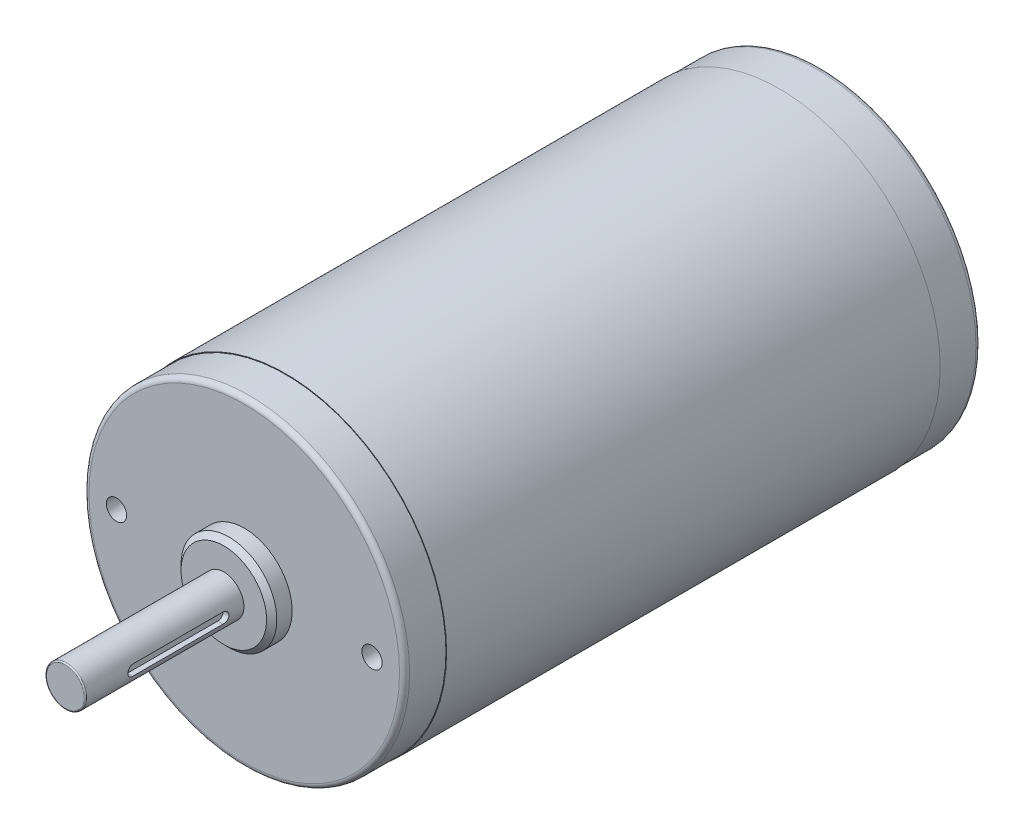
ISO-10303-21;
HEADER;
FILE_DESCRIPTION(('STEP AP214'),'2;1');
FILE_NAME('part.step','',(''),(''),'','','');
FILE_SCHEMA(('AUTOMOTIVE_DESIGN { 1 0 10303 214 1 1 1 1 }'));
ENDSEC;
DATA;
#1=APPLICATION_CONTEXT('core data for automotive mechanical design processes');
#2=APPLICATION_PROTOCOL_DEFINITION('international standard','automotive_design',2000,#1);
#3=PRODUCT_CONTEXT('',#1,'mechanical');
#4=PRODUCT('Part','Part','',(#3));
#5=PRODUCT_RELATED_PRODUCT_CATEGORY('part','',(#4));
#6=PRODUCT_DEFINITION_FORMATION('','',#4);
#7=PRODUCT_DEFINITION_CONTEXT('part definition',#1,'design');
#8=PRODUCT_DEFINITION('design','',#6,#7);
#9=PRODUCT_DEFINITION_SHAPE('','',#8);
#10=(LENGTH_UNIT() NAMED_UNIT(*) SI_UNIT(.MILLI.,.METRE.));
#11=(NAMED_UNIT(*) PLANE_ANGLE_UNIT() SI_UNIT($,.RADIAN.));
#12=(NAMED_UNIT(*) SI_UNIT($,.STERADIAN.) SOLID_ANGLE_UNIT());
#13=UNCERTAINTY_MEASURE_WITH_UNIT(LENGTH_MEASURE(1.E-05),#10,'distance_accuracy_value','');
#14=(GEOMETRIC_REPRESENTATION_CONTEXT(3) GLOBAL_UNCERTAINTY_ASSIGNED_CONTEXT((#13)) GLOBAL_UNIT_ASSIGNED_CONTEXT((#10,
#11,#12)) REPRESENTATION_CONTEXT('',''));
#15=CARTESIAN_POINT('',(0.,0.,0.));
#16=DIRECTION('',(0.,0.,1.));
#17=DIRECTION('',(1.,0.,0.));
#18=AXIS2_PLACEMENT_3D('',#15,#16,#17);
#19=CARTESIAN_POINT('',(35.56,109.2962,54.614));
#20=DIRECTION('',(0.,0.,1.));
#21=DIRECTION('',(1.,0.,0.));
#22=AXIS2_PLACEMENT_3D('',#19,#20,#21);
#23=PLANE('',#22);
#24=CARTESIAN_POINT('',(35.56,109.2962,54.614));
#25=DIRECTION('',(0.,0.,-1.));
#26=DIRECTION('',(-1.,0.,0.));
#27=AXIS2_PLACEMENT_3D('',#24,#25,#26);
#28=CIRCLE('',#27,3.746);
#29=CARTESIAN_POINT('',(31.814,109.2962,54.614));
#30=VERTEX_POINT('',#29);
#31=CARTESIAN_POINT('',(39.306,109.2962,54.614));
#32=VERTEX_POINT('',#31);
#33=EDGE_CURVE('E122',#30,#32,#28,.T.);
#34=ORIENTED_EDGE('',*,*,#33,.F.);
#35=CARTESIAN_POINT('',(39.306,109.2962,54.614));
#36=CARTESIAN_POINT('',(39.3060013001946,109.234906156435,54.614));
#37=CARTESIAN_POINT('',(39.3044956705508,109.173612423503,54.614));
#38=CARTESIAN_POINT('',(39.2984798873383,109.051172560436,54.614));
#39=CARTESIAN_POINT('',(39.2939697337696,108.9900264303,54.614));
#40=CARTESIAN_POINT('',(39.2819542384585,108.868029154351,54.614));
#41=CARTESIAN_POINT('',(39.2744488967163,108.807178008539,54.614));
#42=CARTESIAN_POINT('',(39.2564615159399,108.685917276842,54.614));
#43=CARTESIAN_POINT('',(39.2459794769058,108.625507690958,54.614));
#44=CARTESIAN_POINT('',(39.2220638438752,108.505275616497,54.614));
#45=CARTESIAN_POINT('',(39.2086302498789,108.445453127921,54.614));
#46=CARTESIAN_POINT('',(39.1788438990547,108.326539364244,54.614));
#47=CARTESIAN_POINT('',(39.1624911422269,108.267448089144,54.614));
#48=CARTESIAN_POINT('',(39.1269058530788,108.150139108865,54.614));
#49=CARTESIAN_POINT('',(39.1076733207584,108.091921403687,54.614));
#50=CARTESIAN_POINT('',(39.0663748155928,107.976499814699,54.614));
#51=CARTESIAN_POINT('',(39.0443088427474,107.919295930889,54.614));
#52=CARTESIAN_POINT('',(38.9973966148271,107.806039793832,54.614));
#53=CARTESIAN_POINT('',(38.9725503597521,107.749987540585,54.614));
#54=CARTESIAN_POINT('',(38.9201374243288,107.639169699435,54.614));
#55=CARTESIAN_POINT('',(38.8925707439804,107.584404111532,54.614));
#56=CARTESIAN_POINT('',(38.8347833685174,107.476291536168,54.614));
#57=CARTESIAN_POINT('',(38.8045626734027,107.422944548708,54.614));
#58=CARTESIAN_POINT('',(38.7415400727193,107.317797691796,54.614));
#59=CARTESIAN_POINT('',(38.7087381671506,107.265997822345,54.614));
#60=CARTESIAN_POINT('',(38.64063216822,107.164069991872,54.614));
#61=CARTESIAN_POINT('',(38.6053280748581,107.113942030852,54.614));
#62=CARTESIAN_POINT('',(38.5323027509949,107.015478779891,54.614));
#63=CARTESIAN_POINT('',(38.4945815204937,106.96714348995,54.614));
#64=CARTESIAN_POINT('',(38.4168127961,106.872382025096,54.614));
#65=CARTESIAN_POINT('',(38.3767653022075,106.825955850182,54.614));
#66=CARTESIAN_POINT('',(38.2944405289519,106.735124460104,54.614));
#67=CARTESIAN_POINT('',(38.2521632495887,106.690719244939,54.614));
#68=CARTESIAN_POINT('',(38.1654807550609,106.604036750411,54.614));
#69=CARTESIAN_POINT('',(38.1210755398961,106.561759471048,54.614));
#70=CARTESIAN_POINT('',(38.0302441498177,106.479434697793,54.614));
#71=CARTESIAN_POINT('',(37.9838179749041,106.4393872039,54.614));
#72=CARTESIAN_POINT('',(37.8890565100499,106.361618479506,54.614));
#73=CARTESIAN_POINT('',(37.8407212201092,106.323897249005,54.614));
#74=CARTESIAN_POINT('',(37.7422579691481,106.250871925142,54.614));
#75=CARTESIAN_POINT('',(37.6921300081275,106.21556783178,54.614));
#76=CARTESIAN_POINT('',(37.5902021776553,106.147461832849,54.614));
#77=CARTESIAN_POINT('',(37.5384023082037,106.11465992728,54.614));
#78=CARTESIAN_POINT('',(37.4332554512919,106.051637326598,54.614));
#79=CARTESIAN_POINT('',(37.3799084638318,106.021416631485,54.614));
#80=CARTESIAN_POINT('',(37.2717958884686,105.963629256017,54.614));
#81=CARTESIAN_POINT('',(37.2170303005654,105.936062575662,54.614));
#82=CARTESIAN_POINT('',(37.1062124594143,105.883649640257,54.614));
#83=CARTESIAN_POINT('',(37.0501602061662,105.858803385207,54.614));
#84=CARTESIAN_POINT('',(36.936904069113,105.811891157218,54.614));
#85=CARTESIAN_POINT('',(36.8797001853078,105.789825184278,54.614));
#86=CARTESIAN_POINT('',(36.7642785963067,105.74852667937,54.614));
#87=CARTESIAN_POINT('',(36.7060608911109,105.729294147402,54.614));
#88=CARTESIAN_POINT('',(36.5887519108796,105.693708857292,54.614));
#89=CARTESIAN_POINT('',(36.5296606358442,105.677356099149,54.614));
#90=CARTESIAN_POINT('',(36.4107468719911,105.647569751917,54.614));
#91=CARTESIAN_POINT('',(36.3509243831735,105.634136162827,54.614));
#92=CARTESIAN_POINT('',(36.2306923093714,105.610220516392,54.614));
#93=CARTESIAN_POINT('',(36.1702827243869,105.599738459047,54.614));
#94=CARTESIAN_POINT('',(36.0490219902327,105.581751128297,54.614));
#95=CARTESIAN_POINT('',(35.9881708410629,105.574245854891,54.614));
#96=CARTESIAN_POINT('',(35.8661735742862,105.562230172881,54.614));
#97=CARTESIAN_POINT('',(35.8050274566793,105.557719764276,54.614));
#98=CARTESIAN_POINT('',(35.6825875593817,105.551704677835,54.614));
#99=CARTESIAN_POINT('',(35.6212937796908,105.5502,54.614));
#100=CARTESIAN_POINT('',(35.4987062203092,105.5502,54.614));
#101=CARTESIAN_POINT('',(35.4374124406183,105.551704677835,54.614));
#102=CARTESIAN_POINT('',(35.3149725433206,105.557719764276,54.614));
#103=CARTESIAN_POINT('',(35.2538264257138,105.562230172881,54.614));
#104=CARTESIAN_POINT('',(35.1318291589371,105.574245854891,54.614));
#105=CARTESIAN_POINT('',(35.0709780097673,105.581751128297,54.614));
#106=CARTESIAN_POINT('',(34.9497172756131,105.599738459047,54.614));
#107=CARTESIAN_POINT('',(34.8893076906286,105.610220516392,54.614));
#108=CARTESIAN_POINT('',(34.7690756168265,105.634136162827,54.614));
#109=CARTESIAN_POINT('',(34.7092531280089,105.647569751917,54.614));
#110=CARTESIAN_POINT('',(34.5903393641559,105.677356099149,54.614));
#111=CARTESIAN_POINT('',(34.5312480891204,105.693708857292,54.614));
#112=CARTESIAN_POINT('',(34.4139391088891,105.729294147402,54.614));
#113=CARTESIAN_POINT('',(34.3557214036933,105.748526679371,54.614));
#114=CARTESIAN_POINT('',(34.2402998146922,105.789825184278,54.614));
#115=CARTESIAN_POINT('',(34.183095930887,105.811891157218,54.614));
#116=CARTESIAN_POINT('',(34.0698397938338,105.858803385207,54.614));
#117=CARTESIAN_POINT('',(34.0137875405857,105.883649640257,54.614));
#118=CARTESIAN_POINT('',(33.9029696994346,105.936062575662,54.614));
#119=CARTESIAN_POINT('',(33.8482041115315,105.963629256017,54.614));
#120=CARTESIAN_POINT('',(33.7400915361682,106.021416631485,54.614));
#121=CARTESIAN_POINT('',(33.6867445487081,106.051637326598,54.614));
#122=CARTESIAN_POINT('',(33.5815976917963,106.11465992728,54.614));
#123=CARTESIAN_POINT('',(33.5297978223447,106.147461832849,54.614));
#124=CARTESIAN_POINT('',(33.4278699918725,106.21556783178,54.614));
#125=CARTESIAN_POINT('',(33.3777420308519,106.250871925142,54.614));
#126=CARTESIAN_POINT('',(33.2792787798908,106.323897249005,54.614));
#127=CARTESIAN_POINT('',(33.2309434899501,106.361618479506,54.614));
#128=CARTESIAN_POINT('',(33.1361820250959,106.4393872039,54.614));
#129=CARTESIAN_POINT('',(33.0897558501823,106.479434697793,54.614));
#130=CARTESIAN_POINT('',(32.9989244601039,106.561759471048,54.614));
#131=CARTESIAN_POINT('',(32.9545192449391,106.604036750411,54.614));
#132=CARTESIAN_POINT('',(32.8678367504113,106.690719244939,54.614));
#133=CARTESIAN_POINT('',(32.8255594710481,106.735124460104,54.614));
#134=CARTESIAN_POINT('',(32.7432346977925,106.825955850182,54.614));
#135=CARTESIAN_POINT('',(32.7031872039001,106.872382025096,54.614));
#136=CARTESIAN_POINT('',(32.6254184795063,106.96714348995,54.614));
#137=CARTESIAN_POINT('',(32.5876972490051,107.015478779891,54.614));
#138=CARTESIAN_POINT('',(32.5146719251419,107.113942030852,54.614));
#139=CARTESIAN_POINT('',(32.47936783178,107.164069991872,54.614));
#140=CARTESIAN_POINT('',(32.4112618328494,107.265997822345,54.614));
#141=CARTESIAN_POINT('',(32.3784599272807,107.317797691796,54.614));
#142=CARTESIAN_POINT('',(32.3154373265973,107.422944548708,54.614));
#143=CARTESIAN_POINT('',(32.2852166314826,107.476291536168,54.614));
#144=CARTESIAN_POINT('',(32.2274292560196,107.584404111532,54.614));
#145=CARTESIAN_POINT('',(32.1998625756713,107.639169699435,54.614));
#146=CARTESIAN_POINT('',(32.1474496402479,107.749987540585,54.614));
#147=CARTESIAN_POINT('',(32.1226033851729,107.806039793832,54.614));
#148=CARTESIAN_POINT('',(32.0756911572526,107.919295930889,54.614));
#149=CARTESIAN_POINT('',(32.0536251844072,107.976499814699,54.614));
#150=CARTESIAN_POINT('',(32.0123266792416,108.091921403687,54.614));
#151=CARTESIAN_POINT('',(31.9930941469212,108.150139108866,54.614));
#152=CARTESIAN_POINT('',(31.9575088577731,108.267448089144,54.614));
#153=CARTESIAN_POINT('',(31.9411561009453,108.326539364244,54.614));
#154=CARTESIAN_POINT('',(31.9113697501212,108.445453127921,54.614));
#155=CARTESIAN_POINT('',(31.8979361561248,108.505275616497,54.614));
#156=CARTESIAN_POINT('',(31.8740205230943,108.625507690958,54.614));
#157=CARTESIAN_POINT('',(31.8635384840601,108.685917276842,54.614));
#158=CARTESIAN_POINT('',(31.8455511032837,108.807178008539,54.614));
#159=CARTESIAN_POINT('',(31.8380457615415,108.868029154351,54.614));
#160=CARTESIAN_POINT('',(31.8260302662304,108.9900264303,54.614));
#161=CARTESIAN_POINT('',(31.8215201126617,109.051172560436,54.614));
#162=CARTESIAN_POINT('',(31.8155043294492,109.173612423503,54.614));
#163=CARTESIAN_POINT('',(31.8139986998054,109.234906156435,54.614));
#164=CARTESIAN_POINT('',(31.814,109.2962,54.614));
#165=B_SPLINE_CURVE_WITH_KNOTS('',3,(#35,#36,#37,#38,#39,#40,#41,#42,#43,#44,#45,#46,#47,#48,
#49,#50,#51,#52,#53,#54,#55,#56,#57,#58,#59,#60,#61,#62,#63,#64,#65,#66,#67,#68,#69,#70,#71,#72,
#73,#74,#75,#76,#77,#78,#79,#80,#81,#82,#83,#84,#85,#86,#87,#88,#89,#90,#91,#92,#93,#94,#95,#96,
#97,#98,#99,#100,#101,#102,#103,#104,#105,#106,#107,#108,#109,#110,#111,#112,#113,#114,#115,
#116,#117,#118,#119,#120,#121,#122,#123,#124,#125,#126,#127,#128,#129,#130,#131,#132,#133,#134,
#135,#136,#137,#138,#139,#140,#141,#142,#143,#144,#145,#146,#147,#148,#149,#150,#151,#152,#153,
#154,#155,#156,#157,#158,#159,#160,#161,#162,#163,#164),.UNSPECIFIED.,.F.,.F.,(4,2,2,2,2,2,2,2,
2,2,2,2,2,2,2,2,2,2,2,2,2,2,2,2,2,2,2,2,2,2,2,2,2,2,2,2,2,2,2,2,2,2,2,2,2,2,2,2,2,2,2,2,2,2,2,2,
2,2,2,2,2,2,2,2,4),(0.,0.183862884093666,0.367725768187327,0.551588652280982,0.735451536374632,
0.919314420468288,1.10317730456196,1.28704018865561,1.47090307274927,1.65476595684293,
1.83862884093659,2.02249172503025,2.2063546091239,2.39021749321756,2.57408037731123,
2.75794326140489,2.94180614549854,3.1256690295922,3.30953191368586,3.49339479777952,
3.67725768187318,3.86112056596683,4.04498345006049,4.22884633415415,4.41270921824781,
4.59657210234147,4.78043498643513,4.96429787052879,5.14816075462245,5.3320236387161,
5.51588652280976,5.69974940690342,5.88361229099708,6.06747517509073,6.2513380591844,
6.43520094327805,6.61906382737171,6.80292671146537,6.98678959555903,7.17065247965268,
7.35451536374635,7.53837824784,7.72224113193366,7.90610401602731,8.08996690012097,
8.27382978421462,8.45769266830829,8.64155555240195,8.82541843649561,9.00928132058926,
9.19314420468292,9.37700708877658,9.56086997287023,9.74473285696389,9.92859574105756,
10.1124586251512,10.2963215092449,10.4801843933385,10.6640472774322,10.8479101615258,
11.0317730456195,11.2156359297132,11.3994988138068,11.5833616979005,11.7672245819941),.UNSPECIFIED.);
#166=EDGE_CURVE('E115',#32,#30,#165,.T.);
#167=ORIENTED_EDGE('',*,*,#166,.F.);
#168=EDGE_LOOP('',(#34,#167));
#169=FACE_BOUND('',#168,.T.);
#170=ADVANCED_FACE('F17',(#169),#23,.T.);
#171=CARTESIAN_POINT('',(38.36,109.2962,16.4984772079));
#172=DIRECTION('',(1.,0.,0.));
#173=DIRECTION('',(0.,0.,-1.));
#174=AXIS2_PLACEMENT_3D('',#171,#172,#173);
#175=PLANE('',#174);
#176=DIRECTION('',(0.,0.,1.));
#177=VECTOR('',#176,1.);
#178=CARTESIAN_POINT('',(38.36,108.2462,16.4984772079));
#179=LINE('',#178,#177);
#180=CARTESIAN_POINT('',(38.36,108.2462,27.0999999998));
#181=VERTEX_POINT('',#180);
#182=CARTESIAN_POINT('',(38.36,108.2462,45.1));
#183=VERTEX_POINT('',#182);
#184=EDGE_CURVE('E110',#181,#183,#179,.T.);
#185=ORIENTED_EDGE('',*,*,#184,.F.);
#186=CARTESIAN_POINT('',(38.36,109.2962,27.1));
#187=DIRECTION('',(1.,0.,0.));
#188=DIRECTION('',(0.,0.,-1.));
#189=AXIS2_PLACEMENT_3D('',#186,#187,#188);
#190=CIRCLE('',#189,1.05);
#191=CARTESIAN_POINT('',(38.36,110.3462,27.1));
#192=VERTEX_POINT('',#191);
#193=EDGE_CURVE('E100',#181,#192,#190,.T.);
#194=ORIENTED_EDGE('',*,*,#193,.T.);
#195=DIRECTION('',(0.,0.,1.));
#196=VECTOR('',#195,1.);
#197=CARTESIAN_POINT('',(38.36,110.3462,16.4984772079));
#198=LINE('',#197,#196);
#199=CARTESIAN_POINT('',(38.36,110.3462,45.1));
#200=VERTEX_POINT('',#199);
#201=EDGE_CURVE('E126',#192,#200,#198,.T.);
#202=ORIENTED_EDGE('',*,*,#201,.T.);
#203=CARTESIAN_POINT('',(38.36,109.2962,45.1));
#204=DIRECTION('',(-1.,0.,0.));
#205=DIRECTION('',(0.,0.,1.));
#206=AXIS2_PLACEMENT_3D('',#203,#204,#205);
#207=CIRCLE('',#206,1.05);
#208=EDGE_CURVE('E94',#200,#183,#207,.F.);
#209=ORIENTED_EDGE('',*,*,#208,.T.);
#210=EDGE_LOOP('',(#185,#194,#202,#209));
#211=FACE_BOUND('',#210,.T.);
#212=ADVANCED_FACE('F111',(#211),#175,.T.);
#213=CARTESIAN_POINT('',(38.36,108.2462,16.4984772079));
#214=DIRECTION('',(0.,1.,0.));
#215=DIRECTION('',(0.,0.,1.));
#216=AXIS2_PLACEMENT_3D('',#213,#214,#215);
#217=PLANE('',#216);
#218=DIRECTION('',(0.,0.,-1.));
#219=VECTOR('',#218,1.);
#220=CARTESIAN_POINT('',(39.4197279696898,108.246200000003,54.614));
#221=LINE('',#220,#219);
#222=CARTESIAN_POINT('',(39.4197279696894,108.246200000001,27.0999999998));
#223=VERTEX_POINT('',#222);
#224=CARTESIAN_POINT('',(39.4197279696894,108.246200000001,45.0999999998));
#225=VERTEX_POINT('',#224);
#226=EDGE_CURVE('E119',#223,#225,#221,.F.);
#227=ORIENTED_EDGE('',*,*,#226,.F.);
#228=DIRECTION('',(1.,0.,0.));
#229=VECTOR('',#228,1.);
#230=CARTESIAN_POINT('',(38.36,108.2462,27.0999999996));
#231=LINE('',#230,#229);
#232=EDGE_CURVE('E104',#223,#181,#231,.F.);
#233=ORIENTED_EDGE('',*,*,#232,.T.);
#234=ORIENTED_EDGE('',*,*,#184,.T.);
#235=DIRECTION('',(1.,0.,0.));
#236=VECTOR('',#235,1.);
#237=CARTESIAN_POINT('',(38.36,108.2462,45.1));
#238=LINE('',#237,#236);
#239=EDGE_CURVE('E120',#183,#225,#238,.T.);
#240=ORIENTED_EDGE('',*,*,#239,.T.);
#241=EDGE_LOOP('',(#227,#233,#234,#240));
#242=FACE_BOUND('',#241,.T.);
#243=ADVANCED_FACE('F117',(#242),#217,.T.);
#244=CARTESIAN_POINT('',(35.56,109.2962,54.36));
#245=DIRECTION('',(0.,0.,1.));
#246=DIRECTION('',(1.,0.,0.));
#247=AXIS2_PLACEMENT_3D('',#244,#245,#246);
#248=TOROIDAL_SURFACE('',#247,3.746,0.254);
#249=ORIENTED_EDGE('',*,*,#166,.T.);
#250=ORIENTED_EDGE('',*,*,#33,.T.);
#251=EDGE_LOOP('',(#249,#250));
#252=FACE_BOUND('',#251,.T.);
#253=CARTESIAN_POINT('',(35.56,109.2962,54.36));
#254=DIRECTION('',(0.,0.,-1.));
#255=DIRECTION('',(-1.,0.,0.));
#256=AXIS2_PLACEMENT_3D('',#253,#254,#255);
#257=CIRCLE('',#256,4.);
#258=CARTESIAN_POINT('',(31.56,109.2962,54.36));
#259=VERTEX_POINT('',#258);
#260=EDGE_CURVE('E172',#259,#259,#257,.T.);
#261=ORIENTED_EDGE('',*,*,#260,.F.);
#262=EDGE_LOOP('',(#261));
#263=FACE_BOUND('',#262,.T.);
#264=ADVANCED_FACE('F153',(#252,#263),#248,.T.);
#265=CARTESIAN_POINT('',(38.36,109.2962,45.1));
#266=DIRECTION('',(-1.,0.,0.));
#267=DIRECTION('',(0.,0.,1.));
#268=AXIS2_PLACEMENT_3D('',#265,#266,#267);
#269=CYLINDRICAL_SURFACE('',#268,1.05);
#270=DIRECTION('',(1.,0.,0.));
#271=VECTOR('',#270,1.);
#272=CARTESIAN_POINT('',(38.36,110.3462,45.1));
#273=LINE('',#272,#271);
#274=CARTESIAN_POINT('',(39.4197279696894,110.346199999999,45.1));
#275=VERTEX_POINT('',#274);
#276=EDGE_CURVE('E108',#200,#275,#273,.T.);
#277=ORIENTED_EDGE('',*,*,#276,.T.);
#278=CARTESIAN_POINT('',(39.4197279696891,108.2462,45.0999999996));
#279=CARTESIAN_POINT('',(39.4197258950737,108.246199589739,45.1289948986368));
#280=CARTESIAN_POINT('',(39.4200551064267,108.247401772721,45.1579753767929));
#281=CARTESIAN_POINT('',(39.4213547123867,108.252193790121,45.21571857136));
#282=CARTESIAN_POINT('',(39.4223249907942,108.255783191833,45.24448132628));
#283=CARTESIAN_POINT('',(39.4261578920287,108.270078067147,45.3300048835476));
#284=CARTESIAN_POINT('',(39.429942834262,108.284310457586,45.3861763503085));
#285=CARTESIAN_POINT('',(39.4395286888714,108.321713164792,45.4952257959369));
#286=CARTESIAN_POINT('',(39.4453293264128,108.344882263111,45.5481042226433));
#287=CARTESIAN_POINT('',(39.4582892232305,108.399469503699,45.6492511440254));
#288=CARTESIAN_POINT('',(39.4654488628317,108.430889956107,45.6975183425228));
#289=CARTESIAN_POINT('',(39.4805119709918,108.501890362727,45.7892077697983));
#290=CARTESIAN_POINT('',(39.4884281884527,108.541632256619,45.832502466842));
#291=CARTESIAN_POINT('',(39.5040047399994,108.627813145634,45.9119068742463));
#292=CARTESIAN_POINT('',(39.5116649817746,108.674254525314,45.9480140153937));
#293=CARTESIAN_POINT('',(39.5260106048334,108.77341237943,46.0125503894068));
#294=CARTESIAN_POINT('',(39.5326785634974,108.82621683091,46.040848518495));
#295=CARTESIAN_POINT('',(39.5441298010214,108.936002053832,46.0880888398653));
#296=CARTESIAN_POINT('',(39.5489153446991,108.992977708165,46.1070422821623));
#297=CARTESIAN_POINT('',(39.5549473168666,109.091228422357,46.1306241726671));
#298=CARTESIAN_POINT('',(39.5568321627625,109.131853765155,46.1378772746344));
#299=CARTESIAN_POINT('',(39.5593590428483,109.213713896247,46.1475660347435));
#300=CARTESIAN_POINT('',(39.5600011009139,109.254948672817,46.1500017854335));
#301=CARTESIAN_POINT('',(39.55999845492,109.354094261643,46.1499974942296));
#302=CARTESIAN_POINT('',(39.5587300938833,109.412021122661,46.145193827697));
#303=CARTESIAN_POINT('',(39.5537908073877,109.526225171743,46.1261319193829));
#304=CARTESIAN_POINT('',(39.5501176251491,109.582500758305,46.1118647965529));
#305=CARTESIAN_POINT('',(39.5407752151886,109.691711041936,46.0743710095572));
#306=CARTESIAN_POINT('',(39.5351088856793,109.744650458996,46.051157349786));
#307=CARTESIAN_POINT('',(39.5223803452478,109.845880148194,45.9964722913931));
#308=CARTESIAN_POINT('',(39.5153181479082,109.894170465564,45.9650009731229));
#309=CARTESIAN_POINT('',(39.5003832391546,109.985824414736,45.8939447079381));
#310=CARTESIAN_POINT('',(39.4924970081333,110.029068444468,45.8542083308329));
#311=CARTESIAN_POINT('',(39.4768899553604,110.108363690847,45.7680700177909));
#312=CARTESIAN_POINT('',(39.4691691622904,110.144413669136,45.7216669366335));
#313=CARTESIAN_POINT('',(39.4546281048764,110.208880604601,45.6225587145475));
#314=CARTESIAN_POINT('',(39.447825217303,110.237158627992,45.5697605148943));
#315=CARTESIAN_POINT('',(39.4360941322254,110.284374941225,45.4599645484903));
#316=CARTESIAN_POINT('',(39.4311644713834,110.303320524877,45.4029701015122));
#317=CARTESIAN_POINT('',(39.4249475361859,110.326869937939,45.3047298342851));
#318=CARTESIAN_POINT('',(39.4230031721638,110.33410655235,45.2641375465203));
#319=CARTESIAN_POINT('',(39.4203876966108,110.343775049385,45.1823710407103));
#320=CARTESIAN_POINT('',(39.4197157897826,110.346209933172,45.1411972023641));
#321=CARTESIAN_POINT('',(39.4197279696891,110.3462,45.0999999997));
#322=B_SPLINE_CURVE_WITH_KNOTS('',3,(#278,#279,#280,#281,#282,#283,#284,#285,#286,#287,#288,
#289,#290,#291,#292,#293,#294,#295,#296,#297,#298,#299,#300,#301,#302,#303,#304,#305,#306,#307,
#308,#309,#310,#311,#312,#313,#314,#315,#316,#317,#318,#319,#320,#321),.UNSPECIFIED.,.F.,.F.,(4,
2,2,2,2,2,2,2,2,2,2,2,2,2,2,2,2,2,2,2,2,4),(0.,0.0869295778808043,0.173843403280857,
0.347151826869113,0.520436629580491,0.693769998789454,0.870856390811265,1.04800596967421,
1.22797015519799,1.40771715058583,1.53136439700573,1.65500926795834,1.82853892139324,
2.0022316558149,2.17567286261319,2.34911238180099,2.52606492412327,2.70304790015912,
2.88301467909287,3.0628405801145,3.18638852112258,3.30985921804494),.UNSPECIFIED.);
#323=EDGE_CURVE('E177',#225,#275,#322,.T.);
#324=ORIENTED_EDGE('',*,*,#323,.F.);
#325=ORIENTED_EDGE('',*,*,#239,.F.);
#326=ORIENTED_EDGE('',*,*,#208,.F.);
#327=EDGE_LOOP('',(#277,#324,#325,#326));
#328=FACE_BOUND('',#327,.T.);
#329=ADVANCED_FACE('F163',(#328),#269,.F.);
#330=CARTESIAN_POINT('',(38.36,110.3462,16.4984772079));
#331=DIRECTION('',(0.,1.,0.));
#332=DIRECTION('',(0.,0.,1.));
#333=AXIS2_PLACEMENT_3D('',#330,#331,#332);
#334=PLANE('',#333);
#335=ORIENTED_EDGE('',*,*,#276,.F.);
#336=ORIENTED_EDGE('',*,*,#201,.F.);
#337=DIRECTION('',(1.,0.,0.));
#338=VECTOR('',#337,1.);
#339=CARTESIAN_POINT('',(38.36,110.3462,27.1));
#340=LINE('',#339,#338);
#341=CARTESIAN_POINT('',(39.4197279696894,110.346199999999,27.0999999998));
#342=VERTEX_POINT('',#341);
#343=EDGE_CURVE('E106',#192,#342,#340,.T.);
#344=ORIENTED_EDGE('',*,*,#343,.T.);
#345=DIRECTION('',(0.,0.,-1.));
#346=VECTOR('',#345,1.);
#347=CARTESIAN_POINT('',(39.4197279696898,110.346199999997,54.614));
#348=LINE('',#347,#346);
#349=EDGE_CURVE('E173',#275,#342,#348,.T.);
#350=ORIENTED_EDGE('',*,*,#349,.F.);
#351=EDGE_LOOP('',(#335,#336,#344,#350));
#352=FACE_BOUND('',#351,.T.);
#353=ADVANCED_FACE('F583',(#352),#334,.F.);
#354=CARTESIAN_POINT('',(38.36,109.2962,27.1));
#355=DIRECTION('',(1.,0.,0.));
#356=DIRECTION('',(0.,0.,-1.));
#357=AXIS2_PLACEMENT_3D('',#354,#355,#356);
#358=CYLINDRICAL_SURFACE('',#357,1.05);
#359=ORIENTED_EDGE('',*,*,#193,.F.);
#360=ORIENTED_EDGE('',*,*,#232,.F.);
#361=CARTESIAN_POINT('',(39.4197279696891,110.3462,27.0999999996));
#362=CARTESIAN_POINT('',(39.4197258950798,110.346200410239,27.0710051005614));
#363=CARTESIAN_POINT('',(39.4200551064388,110.344998227234,27.0420246224046));
#364=CARTESIAN_POINT('',(39.4213547124107,110.34020620979,26.9842814278379));
#365=CARTESIAN_POINT('',(39.4223249908242,110.336616808056,26.9555186729192));
#366=CARTESIAN_POINT('',(39.426157892076,110.322321932675,26.8699951156581));
#367=CARTESIAN_POINT('',(39.4299428343203,110.308089542192,26.8138236489056));
#368=CARTESIAN_POINT('',(39.4395286889492,110.270686834899,26.7047742033012));
#369=CARTESIAN_POINT('',(39.4453293264991,110.247517736538,26.6518957766106));
#370=CARTESIAN_POINT('',(39.4582892233304,110.192930495867,26.5507488552668));
#371=CARTESIAN_POINT('',(39.4654488629369,110.16151004342,26.5024816567919));
#372=CARTESIAN_POINT('',(39.4805119711036,110.090509636723,26.4107922295672));
#373=CARTESIAN_POINT('',(39.488428188566,110.050767742793,26.3674975325523));
#374=CARTESIAN_POINT('',(39.5040047401114,109.964586853708,26.2880931252112));
#375=CARTESIAN_POINT('',(39.5116649818839,109.918145473994,26.2519859840986));
#376=CARTESIAN_POINT('',(39.5260106049325,109.81898761982,26.187449610164));
#377=CARTESIAN_POINT('',(39.5326785635891,109.766183168318,26.159151481119));
#378=CARTESIAN_POINT('',(39.544129801095,109.656397945357,26.1119111598388));
#379=CARTESIAN_POINT('',(39.5489153447621,109.599422291008,26.0929577175886));
#380=CARTESIAN_POINT('',(39.554947316901,109.501171576944,26.0693758272001));
#381=CARTESIAN_POINT('',(39.5568321627837,109.460546234293,26.0621227252842));
#382=CARTESIAN_POINT('',(39.559359042852,109.378686103501,26.0524339652426));
#383=CARTESIAN_POINT('',(39.5600011009134,109.337451327083,26.0499982145686));
#384=CARTESIAN_POINT('',(39.5599984549208,109.2383057384,26.0500025057675));
#385=CARTESIAN_POINT('',(39.5587300938844,109.180378877373,26.0548061722987));
#386=CARTESIAN_POINT('',(39.5537908073886,109.066174828272,26.0738680806133));
#387=CARTESIAN_POINT('',(39.5501176251496,109.0098992417,26.0881352034452));
#388=CARTESIAN_POINT('',(39.5407752151881,108.900688958059,26.1256289904447));
#389=CARTESIAN_POINT('',(39.5351088856786,108.847749540998,26.1488426502166));
#390=CARTESIAN_POINT('',(39.5223803452469,108.746519851799,26.2035277086108));
#391=CARTESIAN_POINT('',(39.5153181479072,108.698229534429,26.2349990268818));
#392=CARTESIAN_POINT('',(39.5003832391534,108.606575585257,26.3060552920677));
#393=CARTESIAN_POINT('',(39.4924970081321,108.563331555525,26.3457916691733));
#394=CARTESIAN_POINT('',(39.4768899553592,108.484036309147,26.431929982216));
#395=CARTESIAN_POINT('',(39.4691691622892,108.447986330859,26.4783330633738));
#396=CARTESIAN_POINT('',(39.4546281048753,108.383519395394,26.5774412854605));
#397=CARTESIAN_POINT('',(39.4478252173019,108.355241372004,26.6302394851141));
#398=CARTESIAN_POINT('',(39.4360941322246,108.308025058772,26.7400354515185));
#399=CARTESIAN_POINT('',(39.4311644713827,108.28907947512,26.7970298984968));
#400=CARTESIAN_POINT('',(39.4249475361927,108.265530062087,26.8952701656093));
#401=CARTESIAN_POINT('',(39.4230031721746,108.25829344769,26.9358624532562));
#402=CARTESIAN_POINT('',(39.4203876966219,108.248624950656,27.0176289588283));
#403=CARTESIAN_POINT('',(39.4197157897902,108.246190066855,27.0588027970543));
#404=CARTESIAN_POINT('',(39.4197279696891,108.2462,27.0999999996));
#405=B_SPLINE_CURVE_WITH_KNOTS('',3,(#361,#362,#363,#364,#365,#366,#367,#368,#369,#370,#371,
#372,#373,#374,#375,#376,#377,#378,#379,#380,#381,#382,#383,#384,#385,#386,#387,#388,#389,#390,
#391,#392,#393,#394,#395,#396,#397,#398,#399,#400,#401,#402,#403,#404),.UNSPECIFIED.,.F.,.F.,(4,
2,2,2,2,2,2,2,2,2,2,2,2,2,2,2,2,2,2,2,2,4),(0.,0.0869295778860896,0.173843403291376,
0.347151826890125,0.52043662961174,0.693769998830916,0.870856390865897,1.04800596974219,
1.22797015526451,1.40771715064924,1.53136439661175,1.6550092671071,1.82853892056976,
2.00223165502069,2.17567286182144,2.34911238101127,2.5260649233335,2.70304789936957,
2.8830146783037,3.06284057932492,3.18638851997972,3.30985921654752),.UNSPECIFIED.);
#406=EDGE_CURVE('E176',#342,#223,#405,.T.);
#407=ORIENTED_EDGE('',*,*,#406,.F.);
#408=ORIENTED_EDGE('',*,*,#343,.F.);
#409=EDGE_LOOP('',(#359,#360,#407,#408));
#410=FACE_BOUND('',#409,.T.);
#411=ADVANCED_FACE('F101',(#410),#358,.F.);
#412=CARTESIAN_POINT('',(35.56,109.2962,54.614));
#413=DIRECTION('',(0.,0.,-1.));
#414=DIRECTION('',(-1.,0.,0.));
#415=AXIS2_PLACEMENT_3D('',#412,#413,#414);
#416=CYLINDRICAL_SURFACE('',#415,4.);
#417=ORIENTED_EDGE('',*,*,#226,.T.);
#418=ORIENTED_EDGE('',*,*,#323,.T.);
#419=ORIENTED_EDGE('',*,*,#349,.T.);
#420=ORIENTED_EDGE('',*,*,#406,.T.);
#421=EDGE_LOOP('',(#417,#418,#419,#420));
#422=FACE_BOUND('',#421,.T.);
#423=CARTESIAN_POINT('',(35.56,109.2962,23.114));
#424=DIRECTION('',(0.,0.,-1.));
#425=DIRECTION('',(-1.,0.,0.));
#426=AXIS2_PLACEMENT_3D('',#423,#424,#425);
#427=CIRCLE('',#426,4.);
#428=CARTESIAN_POINT('',(31.56,109.2962,23.114));
#429=VERTEX_POINT('',#428);
#430=EDGE_CURVE('E227',#429,#429,#427,.T.);
#431=ORIENTED_EDGE('',*,*,#430,.F.);
#432=EDGE_LOOP('',(#431));
#433=FACE_BOUND('',#432,.T.);
#434=ORIENTED_EDGE('',*,*,#260,.T.);
#435=EDGE_LOOP('',(#434));
#436=FACE_BOUND('',#435,.T.);
#437=ADVANCED_FACE('F276',(#422,#433,#436),#416,.T.);
#438=CARTESIAN_POINT('',(35.56,109.2962,23.114));
#439=DIRECTION('',(0.,0.,1.));
#440=DIRECTION('',(1.,0.,0.));
#441=AXIS2_PLACEMENT_3D('',#438,#439,#440);
#442=PLANE('',#441);
#443=ORIENTED_EDGE('',*,*,#430,.T.);
#444=EDGE_LOOP('',(#443));
#445=FACE_BOUND('',#444,.T.);
#446=CARTESIAN_POINT('',(35.56,109.2962,23.1140000000118));
#447=DIRECTION('',(0.,0.,-1.));
#448=DIRECTION('',(-1.,0.,0.));
#449=AXIS2_PLACEMENT_3D('',#446,#447,#448);
#450=CIRCLE('',#449,8.50900000181181);
#451=CARTESIAN_POINT('',(27.0509999981882,109.2962,23.1140000000118));
#452=VERTEX_POINT('',#451);
#453=EDGE_CURVE('E235',#452,#452,#450,.T.);
#454=ORIENTED_EDGE('',*,*,#453,.F.);
#455=EDGE_LOOP('',(#454));
#456=FACE_BOUND('',#455,.T.);
#457=ADVANCED_FACE('F272',(#445,#456),#442,.T.);
#458=CARTESIAN_POINT('',(48.8853596371,127.903290683,-97.802699998));
#459=DIRECTION('',(0.,0.,-1.));
#460=DIRECTION('',(-1.,0.,0.));
#461=AXIS2_PLACEMENT_3D('',#458,#459,#460);
#462=PLANE('',#461);
#463=CARTESIAN_POINT('',(46.7673596371,127.903290683,-97.8026999979988));
#464=DIRECTION('',(0.,0.,1.));
#465=DIRECTION('',(1.,0.,0.));
#466=AXIS2_PLACEMENT_3D('',#463,#464,#465);
#467=CIRCLE('',#466,2.11799999999728);
#468=CARTESIAN_POINT('',(48.8853596370973,127.903290683,-97.8026999979988));
#469=VERTEX_POINT('',#468);
#470=EDGE_CURVE('E298',#469,#469,#467,.T.);
#471=ORIENTED_EDGE('',*,*,#470,.F.);
#472=EDGE_LOOP('',(#471));
#473=FACE_BOUND('',#472,.T.);
#474=ADVANCED_FACE('F268',(#473),#462,.T.);
#475=CARTESIAN_POINT('',(56.2850906809,120.503559639,-97.802699998));
#476=DIRECTION('',(0.,0.,-1.));
#477=DIRECTION('',(-1.,0.,0.));
#478=AXIS2_PLACEMENT_3D('',#475,#476,#477);
#479=PLANE('',#478);
#480=CARTESIAN_POINT('',(54.1670906809,120.503559639,-97.8026999979988));
#481=DIRECTION('',(0.,0.,1.));
#482=DIRECTION('',(0.,-1.,0.));
#483=AXIS2_PLACEMENT_3D('',#480,#481,#482);
#484=CIRCLE('',#483,2.11800000004445);
#485=CARTESIAN_POINT('',(54.1670906809,118.385559638956,-97.8026999979988));
#486=VERTEX_POINT('',#485);
#487=EDGE_CURVE('E301',#486,#486,#484,.T.);
#488=ORIENTED_EDGE('',*,*,#487,.F.);
#489=EDGE_LOOP('',(#488));
#490=FACE_BOUND('',#489,.T.);
#491=ADVANCED_FACE('F256',(#490),#479,.T.);
#492=CARTESIAN_POINT('',(35.56,109.2962,-100.3173));
#493=DIRECTION('',(0.,0.,-1.));
#494=DIRECTION('',(-1.,0.,0.));
#495=AXIS2_PLACEMENT_3D('',#492,#493,#494);
#496=PLANE('',#495);
#497=CARTESIAN_POINT('',(35.56,109.2962,-100.3173));
#498=DIRECTION('',(0.,0.,1.));
#499=DIRECTION('',(1.,0.,0.));
#500=AXIS2_PLACEMENT_3D('',#497,#498,#499);
#501=CIRCLE('',#500,14.0368);
#502=CARTESIAN_POINT('',(49.5968,109.2962,-100.3173));
#503=VERTEX_POINT('',#502);
#504=CARTESIAN_POINT('',(21.5232,109.2962,-100.3173));
#505=VERTEX_POINT('',#504);
#506=EDGE_CURVE('E221',#503,#505,#501,.T.);
#507=ORIENTED_EDGE('',*,*,#506,.F.);
#508=CARTESIAN_POINT('',(35.56,109.2962,-100.3173));
#509=DIRECTION('',(0.,0.,1.));
#510=DIRECTION('',(-1.,0.,0.));
#511=AXIS2_PLACEMENT_3D('',#508,#509,#510);
#512=CIRCLE('',#511,14.0368);
#513=EDGE_CURVE('E304',#505,#503,#512,.T.);
#514=ORIENTED_EDGE('',*,*,#513,.F.);
#515=EDGE_LOOP('',(#507,#514));
#516=FACE_BOUND('',#515,.T.);
#517=ADVANCED_FACE('F245',(#516),#496,.T.);
#518=CARTESIAN_POINT('',(10.16,109.2962,5.43560000016896));
#519=DIRECTION('',(0.,0.,1.));
#520=DIRECTION('',(1.,0.,0.));
#521=AXIS2_PLACEMENT_3D('',#518,#519,#520);
#522=CONICAL_SURFACE('',#521,2.0193000002981,1.02974425749895);
#523=DIRECTION('',(-0.857167300096091,0.,-0.515038075918644));
#524=VECTOR('',#523,1.);
#525=CARTESIAN_POINT('',(499020.32,109.296199999939,299839.776719938));
#526=LINE('',#525,#524);
#527=CARTESIAN_POINT('',(10.1599999999564,109.2962,4.22228214873144));
#528=VERTEX_POINT('',#527);
#529=CARTESIAN_POINT('',(12.1793000000603,109.2962,5.43560000035224));
#530=VERTEX_POINT('',#529);
#531=EDGE_CURVE('E226',#528,#530,#526,.F.);
#532=ORIENTED_EDGE('',*,*,#531,.T.);
#533=CARTESIAN_POINT('',(10.16,109.2962,5.4356));
#534=DIRECTION('',(0.,0.,1.));
#535=DIRECTION('',(1.,0.,0.));
#536=AXIS2_PLACEMENT_3D('',#533,#534,#535);
#537=CIRCLE('',#536,2.0193);
#538=CARTESIAN_POINT('',(8.14069999994632,109.2962,5.43560000035224));
#539=VERTEX_POINT('',#538);
#540=EDGE_CURVE('E219',#530,#539,#537,.T.);
#541=ORIENTED_EDGE('',*,*,#540,.T.);
#542=DIRECTION('',(0.857167300096091,0.,-0.515038075918644));
#543=VECTOR('',#542,1.);
#544=CARTESIAN_POINT('',(-499000.,109.2962,299839.776719938));
#545=LINE('',#544,#543);
#546=EDGE_CURVE('E224',#539,#528,#545,.T.);
#547=ORIENTED_EDGE('',*,*,#546,.T.);
#548=EDGE_LOOP('',(#532,#541,#547));
#549=FACE_BOUND('',#548,.T.);
#550=ADVANCED_FACE('F255',(#549),#522,.F.);
#551=CARTESIAN_POINT('',(10.16,109.2962,5.43560000005527));
#552=DIRECTION('',(0.,0.,1.));
#553=DIRECTION('',(1.,0.,0.));
#554=AXIS2_PLACEMENT_3D('',#551,#552,#553);
#555=CONICAL_SURFACE('',#554,2.01929999998734,1.02974425746657);
#556=ORIENTED_EDGE('',*,*,#546,.F.);
#557=CARTESIAN_POINT('',(10.16,109.2962,5.43560000062));
#558=DIRECTION('',(0.,0.,1.));
#559=DIRECTION('',(1.,0.,0.));
#560=AXIS2_PLACEMENT_3D('',#557,#558,#559);
#561=CIRCLE('',#560,2.0193);
#562=EDGE_CURVE('E218',#539,#530,#561,.T.);
#563=ORIENTED_EDGE('',*,*,#562,.T.);
#564=ORIENTED_EDGE('',*,*,#531,.F.);
#565=EDGE_LOOP('',(#556,#563,#564));
#566=FACE_BOUND('',#565,.T.);
#567=ADVANCED_FACE('F527',(#566),#555,.F.);
#568=CARTESIAN_POINT('',(60.96,109.2962,5.43559999988474));
#569=DIRECTION('',(0.,0.,1.));
#570=DIRECTION('',(1.,0.,0.));
#571=AXIS2_PLACEMENT_3D('',#568,#569,#570);
#572=CONICAL_SURFACE('',#571,2.01929999983573,1.02974425734231);
#573=CARTESIAN_POINT('',(60.959999999767,109.2962,4.22228214867459));
#574=VERTEX_POINT('',#573);
#575=VERTEX_LOOP('',#574);
#576=FACE_BOUND('',#575,.T.);
#577=CARTESIAN_POINT('',(60.96,109.2962,5.43560000062));
#578=DIRECTION('',(0.,0.,1.));
#579=DIRECTION('',(1.,0.,0.));
#580=AXIS2_PLACEMENT_3D('',#577,#578,#579);
#581=CIRCLE('',#580,2.0193);
#582=CARTESIAN_POINT('',(62.9793,109.2962,5.43560000062));
#583=VERTEX_POINT('',#582);
#584=EDGE_CURVE('E215',#583,#583,#581,.T.);
#585=ORIENTED_EDGE('',*,*,#584,.T.);
#586=EDGE_LOOP('',(#585));
#587=FACE_BOUND('',#586,.T.);
#588=ADVANCED_FACE('F517',(#576,#587),#572,.F.);
#589=CARTESIAN_POINT('',(35.56,109.2962,22.098));
#590=DIRECTION('',(0.,0.,-1.));
#591=DIRECTION('',(-1.,0.,0.));
#592=AXIS2_PLACEMENT_3D('',#589,#590,#591);
#593=CONICAL_SURFACE('',#592,9.525,0.785398162499999);
#594=CARTESIAN_POINT('',(35.56,109.2962,22.098));
#595=DIRECTION('',(0.,0.,-1.));
#596=DIRECTION('',(-1.,0.,0.));
#597=AXIS2_PLACEMENT_3D('',#594,#595,#596);
#598=CIRCLE('',#597,9.525);
#599=CARTESIAN_POINT('',(26.035,109.2962,22.098));
#600=VERTEX_POINT('',#599);
#601=EDGE_CURVE('E212',#600,#600,#598,.T.);
#602=ORIENTED_EDGE('',*,*,#601,.F.);
#603=EDGE_LOOP('',(#602));
#604=FACE_BOUND('',#603,.T.);
#605=ORIENTED_EDGE('',*,*,#453,.T.);
#606=EDGE_LOOP('',(#605));
#607=FACE_BOUND('',#606,.T.);
#608=ADVANCED_FACE('F508',(#604,#607),#593,.T.);
#609=CARTESIAN_POINT('',(46.7673596371,127.903290683,-95.602699996391));
#610=DIRECTION('',(0.,0.,1.));
#611=DIRECTION('',(1.,0.,0.));
#612=AXIS2_PLACEMENT_3D('',#609,#610,#611);
#613=CONICAL_SURFACE('',#612,4.31800000154824,0.785398163384529);
#614=CARTESIAN_POINT('',(46.7673596371,127.903290683,-95.6026999969));
#615=DIRECTION('',(0.,0.,1.));
#616=DIRECTION('',(1.,0.,0.));
#617=AXIS2_PLACEMENT_3D('',#614,#615,#616);
#618=CIRCLE('',#617,4.31800000197);
#619=CARTESIAN_POINT('',(51.08535963907,127.903290683,-95.6026999969));
#620=VERTEX_POINT('',#619);
#621=EDGE_CURVE('E209',#620,#620,#618,.T.);
#622=ORIENTED_EDGE('',*,*,#621,.F.);
#623=EDGE_LOOP('',(#622));
#624=FACE_BOUND('',#623,.T.);
#625=ORIENTED_EDGE('',*,*,#470,.T.);
#626=EDGE_LOOP('',(#625));
#627=FACE_BOUND('',#626,.T.);
#628=ADVANCED_FACE('F499',(#624,#627),#613,.T.);
#629=CARTESIAN_POINT('',(54.1670906809,120.503559639,-95.6026999965047));
#630=DIRECTION('',(0.,0.,1.));
#631=DIRECTION('',(0.,-1.,0.));
#632=AXIS2_PLACEMENT_3D('',#629,#630,#631);
#633=CONICAL_SURFACE('',#632,4.31800000153856,0.785398163397448);
#634=CARTESIAN_POINT('',(54.1670906809,120.503559639,-95.6026999969));
#635=DIRECTION('',(0.,0.,1.));
#636=DIRECTION('',(1.,0.,0.));
#637=AXIS2_PLACEMENT_3D('',#634,#635,#636);
#638=CIRCLE('',#637,4.31800000197);
#639=CARTESIAN_POINT('',(58.48509068287,120.503559639,-95.6026999969));
#640=VERTEX_POINT('',#639);
#641=EDGE_CURVE('E206',#640,#640,#638,.T.);
#642=ORIENTED_EDGE('',*,*,#641,.F.);
#643=EDGE_LOOP('',(#642));
#644=FACE_BOUND('',#643,.T.);
#645=ORIENTED_EDGE('',*,*,#487,.T.);
#646=EDGE_LOOP('',(#645));
#647=FACE_BOUND('',#646,.T.);
#648=ADVANCED_FACE('F196',(#644,#647),#633,.T.);
#649=CARTESIAN_POINT('',(35.56,109.2962,-99.3173));
#650=DIRECTION('',(0.,0.,-1.));
#651=DIRECTION('',(-1.,0.,0.));
#652=AXIS2_PLACEMENT_3D('',#649,#650,#651);
#653=TOROIDAL_SURFACE('',#652,14.0368,1.);
#654=ORIENTED_EDGE('',*,*,#513,.T.);
#655=ORIENTED_EDGE('',*,*,#506,.T.);
#656=EDGE_LOOP('',(#654,#655));
#657=FACE_BOUND('',#656,.T.);
#658=CARTESIAN_POINT('',(35.56,109.2962,-99.3173));
#659=DIRECTION('',(0.,0.,1.));
#660=DIRECTION('',(1.,0.,0.));
#661=AXIS2_PLACEMENT_3D('',#658,#659,#660);
#662=CIRCLE('',#661,15.0368);
#663=CARTESIAN_POINT('',(50.5968,109.2962,-99.3173));
#664=VERTEX_POINT('',#663);
#665=EDGE_CURVE('E204',#664,#664,#662,.T.);
#666=ORIENTED_EDGE('',*,*,#665,.F.);
#667=EDGE_LOOP('',(#666));
#668=FACE_BOUND('',#667,.T.);
#669=ADVANCED_FACE('F184',(#657,#668),#653,.T.);
#670=CARTESIAN_POINT('',(10.16,109.2962,19.05));
#671=DIRECTION('',(0.,0.,1.));
#672=DIRECTION('',(1.,0.,0.));
#673=AXIS2_PLACEMENT_3D('',#670,#671,#672);
#674=CYLINDRICAL_SURFACE('',#673,2.0193);
#675=CARTESIAN_POINT('',(10.16,109.2962,19.05));
#676=DIRECTION('',(0.,0.,1.));
#677=DIRECTION('',(1.,0.,0.));
#678=AXIS2_PLACEMENT_3D('',#675,#676,#677);
#679=CIRCLE('',#678,2.0193);
#680=CARTESIAN_POINT('',(12.1793,109.2962,19.05));
#681=VERTEX_POINT('',#680);
#682=EDGE_CURVE('E305',#681,#681,#679,.F.);
#683=ORIENTED_EDGE('',*,*,#682,.F.);
#684=EDGE_LOOP('',(#683));
#685=FACE_BOUND('',#684,.T.);
#686=ORIENTED_EDGE('',*,*,#562,.F.);
#687=ORIENTED_EDGE('',*,*,#540,.F.);
#688=EDGE_LOOP('',(#686,#687));
#689=FACE_BOUND('',#688,.T.);
#690=ADVANCED_FACE('F195',(#685,#689),#674,.F.);
#691=CARTESIAN_POINT('',(60.96,109.2962,19.05));
#692=DIRECTION('',(0.,0.,1.));
#693=DIRECTION('',(1.,0.,0.));
#694=AXIS2_PLACEMENT_3D('',#691,#692,#693);
#695=CYLINDRICAL_SURFACE('',#694,2.0193);
#696=CARTESIAN_POINT('',(60.96,109.2962,19.05));
#697=DIRECTION('',(0.,0.,1.));
#698=DIRECTION('',(1.,0.,0.));
#699=AXIS2_PLACEMENT_3D('',#696,#697,#698);
#700=CIRCLE('',#699,2.0193);
#701=CARTESIAN_POINT('',(62.9793,109.2962,19.05));
#702=VERTEX_POINT('',#701);
#703=EDGE_CURVE('E308',#702,#702,#700,.F.);
#704=ORIENTED_EDGE('',*,*,#703,.F.);
#705=EDGE_LOOP('',(#704));
#706=FACE_BOUND('',#705,.T.);
#707=ORIENTED_EDGE('',*,*,#584,.F.);
#708=EDGE_LOOP('',(#707));
#709=FACE_BOUND('',#708,.T.);
#710=ADVANCED_FACE('F467',(#706,#709),#695,.F.);
#711=CARTESIAN_POINT('',(35.56,109.2962,23.114));
#712=DIRECTION('',(0.,0.,-1.));
#713=DIRECTION('',(-1.,0.,0.));
#714=AXIS2_PLACEMENT_3D('',#711,#712,#713);
#715=CYLINDRICAL_SURFACE('',#714,9.525);
#716=CARTESIAN_POINT('',(35.56,109.2962,19.0500000007));
#717=DIRECTION('',(0.,0.,-1.));
#718=DIRECTION('',(-1.,0.,0.));
#719=AXIS2_PLACEMENT_3D('',#716,#717,#718);
#720=CIRCLE('',#719,9.525);
#721=CARTESIAN_POINT('',(26.035,109.2962,19.0500000007));
#722=VERTEX_POINT('',#721);
#723=EDGE_CURVE('E311',#722,#722,#720,.T.);
#724=ORIENTED_EDGE('',*,*,#723,.F.);
#725=EDGE_LOOP('',(#724));
#726=FACE_BOUND('',#725,.T.);
#727=ORIENTED_EDGE('',*,*,#601,.T.);
#728=EDGE_LOOP('',(#727));
#729=FACE_BOUND('',#728,.T.);
#730=ADVANCED_FACE('F457',(#726,#729),#715,.T.);
#731=CARTESIAN_POINT('',(46.7673596371,127.903290683,-97.802699998));
#732=DIRECTION('',(0.,0.,1.));
#733=DIRECTION('',(1.,0.,0.));
#734=AXIS2_PLACEMENT_3D('',#731,#732,#733);
#735=CYLINDRICAL_SURFACE('',#734,4.31800000197);
#736=CARTESIAN_POINT('',(46.7673596371,127.903290683,-95.5548));
#737=DIRECTION('',(0.,0.,1.));
#738=DIRECTION('',(1.,0.,0.));
#739=AXIS2_PLACEMENT_3D('',#736,#737,#738);
#740=CIRCLE('',#739,4.31800000197);
#741=CARTESIAN_POINT('',(51.08535963907,127.903290683,-95.5548));
#742=VERTEX_POINT('',#741);
#743=EDGE_CURVE('E314',#742,#742,#740,.T.);
#744=ORIENTED_EDGE('',*,*,#743,.F.);
#745=EDGE_LOOP('',(#744));
#746=FACE_BOUND('',#745,.T.);
#747=ORIENTED_EDGE('',*,*,#621,.T.);
#748=EDGE_LOOP('',(#747));
#749=FACE_BOUND('',#748,.T.);
#750=ADVANCED_FACE('F447',(#746,#749),#735,.T.);
#751=CARTESIAN_POINT('',(54.1670906809,120.503559639,-97.802699998));
#752=DIRECTION('',(0.,0.,1.));
#753=DIRECTION('',(1.,0.,0.));
#754=AXIS2_PLACEMENT_3D('',#751,#752,#753);
#755=CYLINDRICAL_SURFACE('',#754,4.31800000197);
#756=CARTESIAN_POINT('',(54.1670906809,120.503559639,-95.5548));
#757=DIRECTION('',(0.,0.,1.));
#758=DIRECTION('',(1.,0.,0.));
#759=AXIS2_PLACEMENT_3D('',#756,#757,#758);
#760=CIRCLE('',#759,4.31800000197);
#761=CARTESIAN_POINT('',(58.48509068287,120.503559639,-95.5548));
#762=VERTEX_POINT('',#761);
#763=EDGE_CURVE('E317',#762,#762,#760,.T.);
#764=ORIENTED_EDGE('',*,*,#763,.F.);
#765=EDGE_LOOP('',(#764));
#766=FACE_BOUND('',#765,.T.);
#767=ORIENTED_EDGE('',*,*,#641,.T.);
#768=EDGE_LOOP('',(#767));
#769=FACE_BOUND('',#768,.T.);
#770=ADVANCED_FACE('F437',(#766,#769),#755,.T.);
#771=CARTESIAN_POINT('',(35.56,109.2962,-100.3173));
#772=DIRECTION('',(0.,0.,1.));
#773=DIRECTION('',(1.,0.,0.));
#774=AXIS2_PLACEMENT_3D('',#771,#772,#773);
#775=CYLINDRICAL_SURFACE('',#774,15.0368);
#776=CARTESIAN_POINT('',(35.56,109.2962,-95.5548000007));
#777=DIRECTION('',(0.,0.,1.));
#778=DIRECTION('',(1.,0.,0.));
#779=AXIS2_PLACEMENT_3D('',#776,#777,#778);
#780=CIRCLE('',#779,15.0368);
#781=CARTESIAN_POINT('',(50.5968,109.2962,-95.5548000007));
#782=VERTEX_POINT('',#781);
#783=EDGE_CURVE('E320',#782,#782,#780,.T.);
#784=ORIENTED_EDGE('',*,*,#783,.F.);
#785=EDGE_LOOP('',(#784));
#786=FACE_BOUND('',#785,.T.);
#787=ORIENTED_EDGE('',*,*,#665,.T.);
#788=EDGE_LOOP('',(#787));
#789=FACE_BOUND('',#788,.T.);
#790=ADVANCED_FACE('F427',(#786,#789),#775,.T.);
#791=CARTESIAN_POINT('',(35.56,109.2962,19.05));
#792=DIRECTION('',(0.,0.,1.));
#793=DIRECTION('',(1.,0.,0.));
#794=AXIS2_PLACEMENT_3D('',#791,#792,#793);
#795=PLANE('',#794);
#796=ORIENTED_EDGE('',*,*,#723,.T.);
#797=EDGE_LOOP('',(#796));
#798=FACE_BOUND('',#797,.T.);
#799=ORIENTED_EDGE('',*,*,#703,.T.);
#800=EDGE_LOOP('',(#799));
#801=FACE_BOUND('',#800,.T.);
#802=ORIENTED_EDGE('',*,*,#682,.T.);
#803=EDGE_LOOP('',(#802));
#804=FACE_BOUND('',#803,.T.);
#805=CARTESIAN_POINT('',(35.56,109.2962,19.05));
#806=DIRECTION('',(0.,0.,-1.));
#807=DIRECTION('',(-1.,0.,0.));
#808=AXIS2_PLACEMENT_3D('',#805,#806,#807);
#809=CIRCLE('',#808,30.877);
#810=CARTESIAN_POINT('',(4.683,109.2962,19.05));
#811=VERTEX_POINT('',#810);
#812=CARTESIAN_POINT('',(66.437,109.2962,19.05));
#813=VERTEX_POINT('',#812);
#814=EDGE_CURVE('E701',#811,#813,#809,.T.);
#815=ORIENTED_EDGE('',*,*,#814,.F.);
#816=CARTESIAN_POINT('',(35.56,109.2962,19.05));
#817=DIRECTION('',(0.,0.,-1.));
#818=DIRECTION('',(1.,0.,0.));
#819=AXIS2_PLACEMENT_3D('',#816,#817,#818);
#820=CIRCLE('',#819,30.877);
#821=EDGE_CURVE('E323',#813,#811,#820,.T.);
#822=ORIENTED_EDGE('',*,*,#821,.F.);
#823=EDGE_LOOP('',(#815,#822));
#824=FACE_BOUND('',#823,.T.);
#825=ADVANCED_FACE('F417',(#798,#801,#804,#824),#795,.T.);
#826=CARTESIAN_POINT('',(35.56,109.2962,-95.5548));
#827=DIRECTION('',(0.,0.,-1.));
#828=DIRECTION('',(-1.,0.,0.));
#829=AXIS2_PLACEMENT_3D('',#826,#827,#828);
#830=PLANE('',#829);
#831=ORIENTED_EDGE('',*,*,#783,.T.);
#832=EDGE_LOOP('',(#831));
#833=FACE_BOUND('',#832,.T.);
#834=ORIENTED_EDGE('',*,*,#763,.T.);
#835=EDGE_LOOP('',(#834));
#836=FACE_BOUND('',#835,.T.);
#837=ORIENTED_EDGE('',*,*,#743,.T.);
#838=EDGE_LOOP('',(#837));
#839=FACE_BOUND('',#838,.T.);
#840=CARTESIAN_POINT('',(35.56,109.2962,-95.5548));
#841=DIRECTION('',(0.,0.,1.));
#842=DIRECTION('',(1.,0.,0.));
#843=AXIS2_PLACEMENT_3D('',#840,#841,#842);
#844=CIRCLE('',#843,30.877);
#845=CARTESIAN_POINT('',(66.437,109.2962,-95.5548));
#846=VERTEX_POINT('',#845);
#847=CARTESIAN_POINT('',(4.683,109.2962,-95.5548));
#848=VERTEX_POINT('',#847);
#849=EDGE_CURVE('E666',#846,#848,#844,.T.);
#850=ORIENTED_EDGE('',*,*,#849,.F.);
#851=CARTESIAN_POINT('',(35.56,109.2962,-95.5548));
#852=DIRECTION('',(0.,0.,1.));
#853=DIRECTION('',(-1.,0.,0.));
#854=AXIS2_PLACEMENT_3D('',#851,#852,#853);
#855=CIRCLE('',#854,30.877);
#856=EDGE_CURVE('E37',#848,#846,#855,.T.);
#857=ORIENTED_EDGE('',*,*,#856,.F.);
#858=EDGE_LOOP('',(#850,#857));
#859=FACE_BOUND('',#858,.T.);
#860=ADVANCED_FACE('F407',(#833,#836,#839,#859),#830,.T.);
#861=CARTESIAN_POINT('',(35.56,109.2962,18.05));
#862=DIRECTION('',(0.,0.,1.));
#863=DIRECTION('',(1.,0.,0.));
#864=AXIS2_PLACEMENT_3D('',#861,#862,#863);
#865=TOROIDAL_SURFACE('',#864,30.877,1.);
#866=ORIENTED_EDGE('',*,*,#821,.T.);
#867=ORIENTED_EDGE('',*,*,#814,.T.);
#868=EDGE_LOOP('',(#866,#867));
#869=FACE_BOUND('',#868,.T.);
#870=CARTESIAN_POINT('',(35.56,109.2962,18.05));
#871=DIRECTION('',(0.,0.,-1.));
#872=DIRECTION('',(-1.,0.,0.));
#873=AXIS2_PLACEMENT_3D('',#870,#871,#872);
#874=CIRCLE('',#873,31.877);
#875=CARTESIAN_POINT('',(3.683,109.2962,18.05));
#876=VERTEX_POINT('',#875);
#877=EDGE_CURVE('E664',#876,#876,#874,.T.);
#878=ORIENTED_EDGE('',*,*,#877,.F.);
#879=EDGE_LOOP('',(#878));
#880=FACE_BOUND('',#879,.T.);
#881=ADVANCED_FACE('F397',(#869,#880),#865,.T.);
#882=CARTESIAN_POINT('',(35.56,109.2962,-94.5548));
#883=DIRECTION('',(0.,0.,-1.));
#884=DIRECTION('',(-1.,0.,0.));
#885=AXIS2_PLACEMENT_3D('',#882,#883,#884);
#886=TOROIDAL_SURFACE('',#885,30.877,1.);
#887=ORIENTED_EDGE('',*,*,#856,.T.);
#888=ORIENTED_EDGE('',*,*,#849,.T.);
#889=EDGE_LOOP('',(#887,#888));
#890=FACE_BOUND('',#889,.T.);
#891=CARTESIAN_POINT('',(35.56,109.2962,-94.5548));
#892=DIRECTION('',(0.,0.,1.));
#893=DIRECTION('',(1.,0.,0.));
#894=AXIS2_PLACEMENT_3D('',#891,#892,#893);
#895=CIRCLE('',#894,31.877);
#896=CARTESIAN_POINT('',(67.437,109.2962,-94.5548));
#897=VERTEX_POINT('',#896);
#898=EDGE_CURVE('E328',#897,#897,#895,.T.);
#899=ORIENTED_EDGE('',*,*,#898,.F.);
#900=EDGE_LOOP('',(#899));
#901=FACE_BOUND('',#900,.T.);
#902=ADVANCED_FACE('F387',(#890,#901),#886,.T.);
#903=CARTESIAN_POINT('',(35.56,109.2962,19.05));
#904=DIRECTION('',(0.,0.,-1.));
#905=DIRECTION('',(-1.,0.,0.));
#906=AXIS2_PLACEMENT_3D('',#903,#904,#905);
#907=CYLINDRICAL_SURFACE('',#906,31.877);
#908=CARTESIAN_POINT('',(35.56,109.2962,10.8204000007));
#909=DIRECTION('',(0.,0.,-1.));
#910=DIRECTION('',(-1.,0.,0.));
#911=AXIS2_PLACEMENT_3D('',#908,#909,#910);
#912=CIRCLE('',#911,31.877);
#913=CARTESIAN_POINT('',(3.683,109.2962,10.8204000007));
#914=VERTEX_POINT('',#913);
#915=EDGE_CURVE('E324',#914,#914,#912,.T.);
#916=ORIENTED_EDGE('',*,*,#915,.F.);
#917=EDGE_LOOP('',(#916));
#918=FACE_BOUND('',#917,.T.);
#919=ORIENTED_EDGE('',*,*,#877,.T.);
#920=EDGE_LOOP('',(#919));
#921=FACE_BOUND('',#920,.T.);
#922=ADVANCED_FACE('F349',(#918,#921),#907,.T.);
#923=CARTESIAN_POINT('',(35.56,109.2962,-95.5548));
#924=DIRECTION('',(0.,0.,1.));
#925=DIRECTION('',(1.,0.,0.));
#926=AXIS2_PLACEMENT_3D('',#923,#924,#925);
#927=CYLINDRICAL_SURFACE('',#926,31.877);
#928=CARTESIAN_POINT('',(35.56,109.2962,-87.3252000007));
#929=DIRECTION('',(0.,0.,1.));
#930=DIRECTION('',(1.,0.,0.));
#931=AXIS2_PLACEMENT_3D('',#928,#929,#930);
#932=CIRCLE('',#931,31.877);
#933=CARTESIAN_POINT('',(67.437,109.2962,-87.3252000007));
#934=VERTEX_POINT('',#933);
#935=EDGE_CURVE('E327',#934,#934,#932,.T.);
#936=ORIENTED_EDGE('',*,*,#935,.F.);
#937=EDGE_LOOP('',(#936));
#938=FACE_BOUND('',#937,.T.);
#939=ORIENTED_EDGE('',*,*,#898,.T.);
#940=EDGE_LOOP('',(#939));
#941=FACE_BOUND('',#940,.T.);
#942=ADVANCED_FACE('F339',(#938,#941),#927,.T.);
#943=CARTESIAN_POINT('',(67.564,109.2962,10.8204));
#944=DIRECTION('',(0.,0.,1.));
#945=DIRECTION('',(1.,0.,0.));
#946=AXIS2_PLACEMENT_3D('',#943,#944,#945);
#947=PLANE('',#946);
#948=ORIENTED_EDGE('',*,*,#915,.T.);
#949=EDGE_LOOP('',(#948));
#950=FACE_BOUND('',#949,.T.);
#951=CARTESIAN_POINT('',(35.56,109.2962,10.8204));
#952=DIRECTION('',(0.,0.,-1.));
#953=DIRECTION('',(-1.,0.,0.));
#954=AXIS2_PLACEMENT_3D('',#951,#952,#953);
#955=CIRCLE('',#954,32.004);
#956=CARTESIAN_POINT('',(3.556,109.2962,10.8204));
#957=VERTEX_POINT('',#956);
#958=EDGE_CURVE('E29',#957,#957,#955,.T.);
#959=ORIENTED_EDGE('',*,*,#958,.F.);
#960=EDGE_LOOP('',(#959));
#961=FACE_BOUND('',#960,.T.);
#962=ADVANCED_FACE('F336',(#950,#961),#947,.T.);
#963=CARTESIAN_POINT('',(35.56,109.2962,-87.3252));
#964=DIRECTION('',(0.,0.,-1.));
#965=DIRECTION('',(-1.,0.,0.));
#966=AXIS2_PLACEMENT_3D('',#963,#964,#965);
#967=PLANE('',#966);
#968=ORIENTED_EDGE('',*,*,#935,.T.);
#969=EDGE_LOOP('',(#968));
#970=FACE_BOUND('',#969,.T.);
#971=CARTESIAN_POINT('',(35.56,109.2962,-87.3252000004));
#972=DIRECTION('',(0.,0.,-1.));
#973=DIRECTION('',(-1.,0.,0.));
#974=AXIS2_PLACEMENT_3D('',#971,#972,#973);
#975=CIRCLE('',#974,32.004);
#976=CARTESIAN_POINT('',(3.556,109.2962,-87.3252000004));
#977=VERTEX_POINT('',#976);
#978=EDGE_CURVE('E11',#977,#977,#975,.F.);
#979=ORIENTED_EDGE('',*,*,#978,.F.);
#980=EDGE_LOOP('',(#979));
#981=FACE_BOUND('',#980,.T.);
#982=ADVANCED_FACE('F338',(#970,#981),#967,.T.);
#983=CARTESIAN_POINT('',(35.56,109.2962,10.8204));
#984=DIRECTION('',(0.,0.,-1.));
#985=DIRECTION('',(-1.,0.,0.));
#986=AXIS2_PLACEMENT_3D('',#983,#984,#985);
#987=CYLINDRICAL_SURFACE('',#986,32.004);
#988=ORIENTED_EDGE('',*,*,#978,.T.);
#989=EDGE_LOOP('',(#988));
#990=FACE_BOUND('',#989,.T.);
#991=ORIENTED_EDGE('',*,*,#958,.T.);
#992=EDGE_LOOP('',(#991));
#993=FACE_BOUND('',#992,.T.);
#994=ADVANCED_FACE('F334',(#990,#993),#987,.T.);
#995=CLOSED_SHELL('',(#170,#212,#243,#264,#329,#353,#411,#437,#457,#474,#491,#517,#550,#567,
#588,#608,#628,#648,#669,#690,#710,#730,#750,#770,#790,#825,#860,#881,#902,#922,#942,#962,#982,#994));
#996=MANIFOLD_SOLID_BREP('B1',#995);
#997=ADVANCED_BREP_SHAPE_REPRESENTATION('',(#18,#996),#14);
#998=SHAPE_DEFINITION_REPRESENTATION(#9,#997);
ENDSEC;
END-ISO-10303-21;
